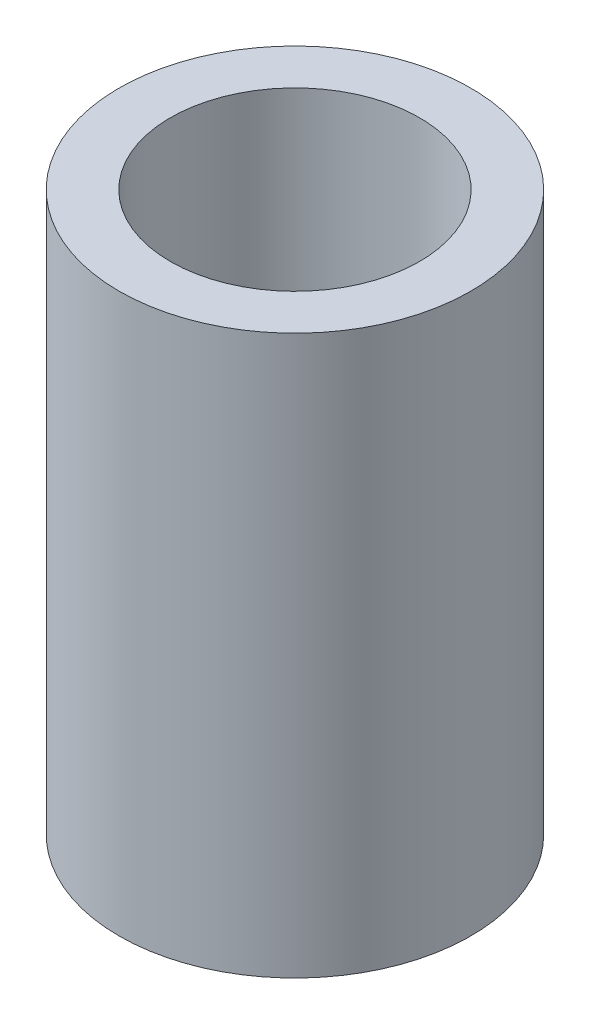
ISO-10303-21;
HEADER;
FILE_DESCRIPTION(('STEP AP214'),'2;1');
FILE_NAME('part.step','',(''),(''),'','','');
FILE_SCHEMA(('AUTOMOTIVE_DESIGN { 1 0 10303 214 1 1 1 1 }'));
ENDSEC;
DATA;
#1=APPLICATION_CONTEXT('core data for automotive mechanical design processes');
#2=APPLICATION_PROTOCOL_DEFINITION('international standard','automotive_design',2000,#1);
#3=PRODUCT_CONTEXT('',#1,'mechanical');
#4=PRODUCT('Part','Part','',(#3));
#5=PRODUCT_RELATED_PRODUCT_CATEGORY('part','',(#4));
#6=PRODUCT_DEFINITION_FORMATION('','',#4);
#7=PRODUCT_DEFINITION_CONTEXT('part definition',#1,'design');
#8=PRODUCT_DEFINITION('design','',#6,#7);
#9=PRODUCT_DEFINITION_SHAPE('','',#8);
#10=(LENGTH_UNIT() NAMED_UNIT(*) SI_UNIT(.MILLI.,.METRE.));
#11=(NAMED_UNIT(*) PLANE_ANGLE_UNIT() SI_UNIT($,.RADIAN.));
#12=(NAMED_UNIT(*) SI_UNIT($,.STERADIAN.) SOLID_ANGLE_UNIT());
#13=UNCERTAINTY_MEASURE_WITH_UNIT(LENGTH_MEASURE(1.E-05),#10,'distance_accuracy_value','');
#14=(GEOMETRIC_REPRESENTATION_CONTEXT(3) GLOBAL_UNCERTAINTY_ASSIGNED_CONTEXT((#13)) GLOBAL_UNIT_ASSIGNED_CONTEXT((#10,
#11,#12)) REPRESENTATION_CONTEXT('',''));
#15=CARTESIAN_POINT('',(0.,0.,0.));
#16=DIRECTION('',(0.,0.,1.));
#17=DIRECTION('',(1.,0.,0.));
#18=AXIS2_PLACEMENT_3D('',#15,#16,#17);
#19=CARTESIAN_POINT('',(0.,19.05,0.));
#20=DIRECTION('',(0.,1.,0.));
#21=DIRECTION('',(0.,0.,1.));
#22=AXIS2_PLACEMENT_3D('',#19,#20,#21);
#23=PLANE('',#22);
#24=CARTESIAN_POINT('',(0.,19.05,0.));
#25=DIRECTION('',(0.,1.,0.));
#26=DIRECTION('',(0.,0.,1.));
#27=AXIS2_PLACEMENT_3D('',#24,#25,#26);
#28=CIRCLE('',#27,6.);
#29=CARTESIAN_POINT('',(0.,19.05,6.));
#30=VERTEX_POINT('',#29);
#31=EDGE_CURVE('E10',#30,#30,#28,.T.);
#32=ORIENTED_EDGE('',*,*,#31,.T.);
#33=EDGE_LOOP('',(#32));
#34=FACE_BOUND('',#33,.T.);
#35=CARTESIAN_POINT('',(0.,19.05,0.));
#36=DIRECTION('',(0.,1.,0.));
#37=DIRECTION('',(0.,0.,1.));
#38=AXIS2_PLACEMENT_3D('',#35,#36,#37);
#39=CIRCLE('',#38,4.25);
#40=CARTESIAN_POINT('',(0.,19.05,4.25));
#41=VERTEX_POINT('',#40);
#42=EDGE_CURVE('E48',#41,#41,#39,.T.);
#43=ORIENTED_EDGE('',*,*,#42,.F.);
#44=EDGE_LOOP('',(#43));
#45=FACE_BOUND('',#44,.T.);
#46=ADVANCED_FACE('F37',(#34,#45),#23,.T.);
#47=CARTESIAN_POINT('',(0.,0.,0.));
#48=DIRECTION('',(0.,1.,0.));
#49=DIRECTION('',(0.,0.,1.));
#50=AXIS2_PLACEMENT_3D('',#47,#48,#49);
#51=PLANE('',#50);
#52=CARTESIAN_POINT('',(0.,0.,0.));
#53=DIRECTION('',(0.,1.,0.));
#54=DIRECTION('',(0.,0.,1.));
#55=AXIS2_PLACEMENT_3D('',#52,#53,#54);
#56=CIRCLE('',#55,6.);
#57=CARTESIAN_POINT('',(0.,0.,6.));
#58=VERTEX_POINT('',#57);
#59=EDGE_CURVE('E41',#58,#58,#56,.T.);
#60=ORIENTED_EDGE('',*,*,#59,.F.);
#61=EDGE_LOOP('',(#60));
#62=FACE_BOUND('',#61,.T.);
#63=CARTESIAN_POINT('',(0.,0.,0.));
#64=DIRECTION('',(0.,1.,0.));
#65=DIRECTION('',(0.,0.,1.));
#66=AXIS2_PLACEMENT_3D('',#63,#64,#65);
#67=CIRCLE('',#66,4.25);
#68=CARTESIAN_POINT('',(0.,0.,4.25));
#69=VERTEX_POINT('',#68);
#70=EDGE_CURVE('E50',#69,#69,#67,.T.);
#71=ORIENTED_EDGE('',*,*,#70,.T.);
#72=EDGE_LOOP('',(#71));
#73=FACE_BOUND('',#72,.T.);
#74=ADVANCED_FACE('F60',(#62,#73),#51,.F.);
#75=CARTESIAN_POINT('',(0.,19.05,0.));
#76=DIRECTION('',(0.,-1.,0.));
#77=DIRECTION('',(0.,0.,-1.));
#78=AXIS2_PLACEMENT_3D('',#75,#76,#77);
#79=CYLINDRICAL_SURFACE('',#78,6.);
#80=ORIENTED_EDGE('',*,*,#31,.F.);
#81=EDGE_LOOP('',(#80));
#82=FACE_BOUND('',#81,.T.);
#83=ORIENTED_EDGE('',*,*,#59,.T.);
#84=EDGE_LOOP('',(#83));
#85=FACE_BOUND('',#84,.T.);
#86=ADVANCED_FACE('F39',(#82,#85),#79,.T.);
#87=CARTESIAN_POINT('',(0.,19.05,0.));
#88=DIRECTION('',(0.,-1.,0.));
#89=DIRECTION('',(0.,0.,-1.));
#90=AXIS2_PLACEMENT_3D('',#87,#88,#89);
#91=CYLINDRICAL_SURFACE('',#90,4.25);
#92=ORIENTED_EDGE('',*,*,#42,.T.);
#93=EDGE_LOOP('',(#92));
#94=FACE_BOUND('',#93,.T.);
#95=ORIENTED_EDGE('',*,*,#70,.F.);
#96=EDGE_LOOP('',(#95));
#97=FACE_BOUND('',#96,.T.);
#98=ADVANCED_FACE('F56',(#94,#97),#91,.F.);
#99=CLOSED_SHELL('',(#46,#74,#86,#98));
#100=MANIFOLD_SOLID_BREP('B2',#99);
#101=ADVANCED_BREP_SHAPE_REPRESENTATION('',(#18,#100),#14);
#102=SHAPE_DEFINITION_REPRESENTATION(#9,#101);
ENDSEC;
END-ISO-10303-21;
